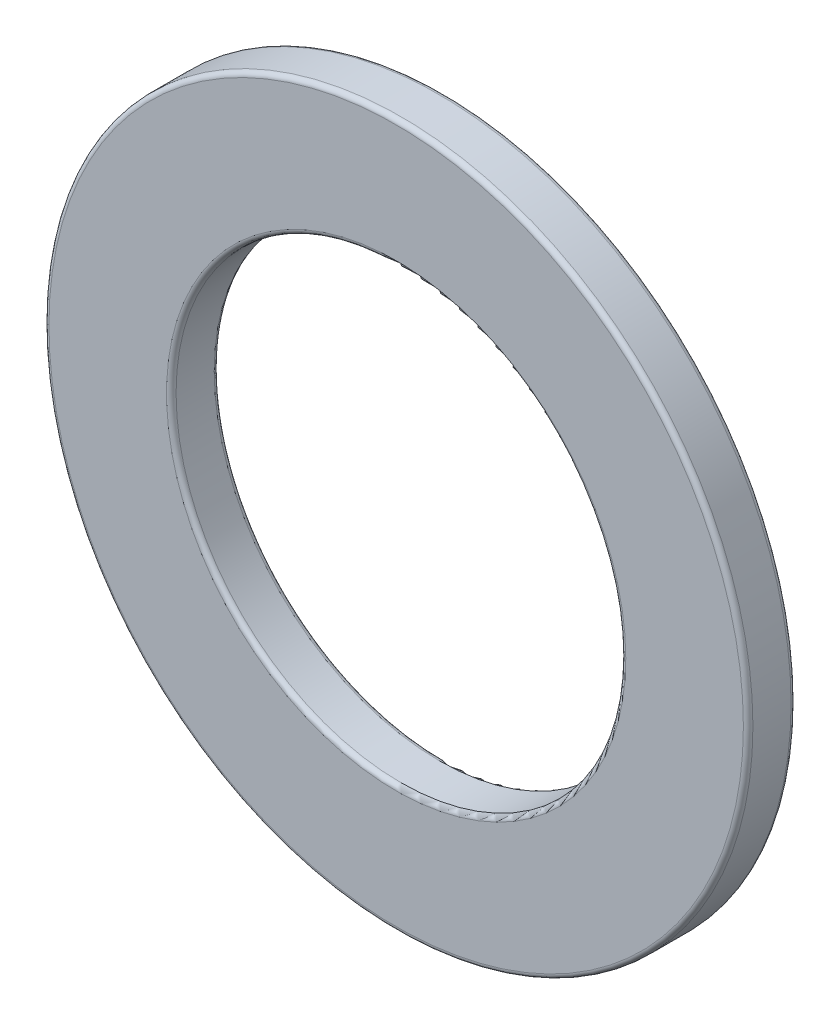
ISO-10303-21;
HEADER;
FILE_DESCRIPTION(('STEP AP214'),'2;1');
FILE_NAME('part.step','',(''),(''),'','','');
FILE_SCHEMA(('AUTOMOTIVE_DESIGN { 1 0 10303 214 1 1 1 1 }'));
ENDSEC;
DATA;
#1=APPLICATION_CONTEXT('core data for automotive mechanical design processes');
#2=APPLICATION_PROTOCOL_DEFINITION('international standard','automotive_design',2000,#1);
#3=PRODUCT_CONTEXT('',#1,'mechanical');
#4=PRODUCT('Part','Part','',(#3));
#5=PRODUCT_RELATED_PRODUCT_CATEGORY('part','',(#4));
#6=PRODUCT_DEFINITION_FORMATION('','',#4);
#7=PRODUCT_DEFINITION_CONTEXT('part definition',#1,'design');
#8=PRODUCT_DEFINITION('design','',#6,#7);
#9=PRODUCT_DEFINITION_SHAPE('','',#8);
#10=(LENGTH_UNIT() NAMED_UNIT(*) SI_UNIT(.MILLI.,.METRE.));
#11=(NAMED_UNIT(*) PLANE_ANGLE_UNIT() SI_UNIT($,.RADIAN.));
#12=(NAMED_UNIT(*) SI_UNIT($,.STERADIAN.) SOLID_ANGLE_UNIT());
#13=UNCERTAINTY_MEASURE_WITH_UNIT(LENGTH_MEASURE(1.E-05),#10,'distance_accuracy_value','');
#14=(GEOMETRIC_REPRESENTATION_CONTEXT(3) GLOBAL_UNCERTAINTY_ASSIGNED_CONTEXT((#13)) GLOBAL_UNIT_ASSIGNED_CONTEXT((#10,
#11,#12)) REPRESENTATION_CONTEXT('',''));
#15=CARTESIAN_POINT('',(0.,0.,0.));
#16=DIRECTION('',(0.,0.,1.));
#17=DIRECTION('',(1.,0.,0.));
#18=AXIS2_PLACEMENT_3D('',#15,#16,#17);
#19=CARTESIAN_POINT('',(0.,0.,-1.5));
#20=DIRECTION('',(0.,0.,1.));
#21=DIRECTION('',(1.,0.,0.));
#22=AXIS2_PLACEMENT_3D('',#19,#20,#21);
#23=CYLINDRICAL_SURFACE('',#22,11.075);
#24=CARTESIAN_POINT('',(0.,0.,-0.15));
#25=DIRECTION('',(0.,0.,1.));
#26=DIRECTION('',(1.,0.,0.));
#27=AXIS2_PLACEMENT_3D('',#24,#25,#26);
#28=CIRCLE('',#27,11.075);
#29=CARTESIAN_POINT('',(11.075,0.,-0.15));
#30=VERTEX_POINT('',#29);
#31=EDGE_CURVE('E63',#30,#30,#28,.F.);
#32=ORIENTED_EDGE('',*,*,#31,.T.);
#33=EDGE_LOOP('',(#32));
#34=FACE_BOUND('',#33,.T.);
#35=CARTESIAN_POINT('',(0.,0.,-1.35));
#36=DIRECTION('',(0.,0.,1.));
#37=DIRECTION('',(1.,0.,0.));
#38=AXIS2_PLACEMENT_3D('',#35,#36,#37);
#39=CIRCLE('',#38,11.075);
#40=CARTESIAN_POINT('',(11.075,0.,-1.35));
#41=VERTEX_POINT('',#40);
#42=EDGE_CURVE('E66',#41,#41,#39,.T.);
#43=ORIENTED_EDGE('',*,*,#42,.T.);
#44=EDGE_LOOP('',(#43));
#45=FACE_BOUND('',#44,.T.);
#46=ADVANCED_FACE('F43',(#34,#45),#23,.T.);
#47=CARTESIAN_POINT('',(0.,0.,-1.5));
#48=DIRECTION('',(0.,0.,1.));
#49=DIRECTION('',(1.,0.,0.));
#50=AXIS2_PLACEMENT_3D('',#47,#48,#49);
#51=PLANE('',#50);
#52=CARTESIAN_POINT('',(0.,0.,-1.5));
#53=DIRECTION('',(0.,0.,1.));
#54=DIRECTION('',(1.,0.,0.));
#55=AXIS2_PLACEMENT_3D('',#52,#53,#54);
#56=CIRCLE('',#55,10.925);
#57=CARTESIAN_POINT('',(10.925,0.,-1.5));
#58=VERTEX_POINT('',#57);
#59=EDGE_CURVE('E54',#58,#58,#56,.F.);
#60=ORIENTED_EDGE('',*,*,#59,.T.);
#61=EDGE_LOOP('',(#60));
#62=FACE_BOUND('',#61,.T.);
#63=CARTESIAN_POINT('',(0.,0.,-1.5));
#64=DIRECTION('',(0.,0.,1.));
#65=DIRECTION('',(1.,0.,0.));
#66=AXIS2_PLACEMENT_3D('',#63,#64,#65);
#67=CIRCLE('',#66,7.225);
#68=CARTESIAN_POINT('',(7.225,0.,-1.5));
#69=VERTEX_POINT('',#68);
#70=EDGE_CURVE('E58',#69,#69,#67,.T.);
#71=ORIENTED_EDGE('',*,*,#70,.T.);
#72=EDGE_LOOP('',(#71));
#73=FACE_BOUND('',#72,.T.);
#74=ADVANCED_FACE('F91',(#62,#73),#51,.F.);
#75=CARTESIAN_POINT('',(0.,0.,0.));
#76=DIRECTION('',(0.,0.,1.));
#77=DIRECTION('',(1.,0.,0.));
#78=AXIS2_PLACEMENT_3D('',#75,#76,#77);
#79=PLANE('',#78);
#80=CARTESIAN_POINT('',(0.,0.,0.));
#81=DIRECTION('',(0.,0.,1.));
#82=DIRECTION('',(1.,0.,0.));
#83=AXIS2_PLACEMENT_3D('',#80,#81,#82);
#84=CIRCLE('',#83,10.925);
#85=CARTESIAN_POINT('',(10.925,0.,0.));
#86=VERTEX_POINT('',#85);
#87=EDGE_CURVE('E69',#86,#86,#84,.T.);
#88=ORIENTED_EDGE('',*,*,#87,.T.);
#89=EDGE_LOOP('',(#88));
#90=FACE_BOUND('',#89,.T.);
#91=CARTESIAN_POINT('',(0.,0.,0.));
#92=DIRECTION('',(0.,0.,1.));
#93=DIRECTION('',(1.,0.,0.));
#94=AXIS2_PLACEMENT_3D('',#91,#92,#93);
#95=CIRCLE('',#94,7.225);
#96=CARTESIAN_POINT('',(7.225,0.,0.));
#97=VERTEX_POINT('',#96);
#98=EDGE_CURVE('E72',#97,#97,#95,.F.);
#99=ORIENTED_EDGE('',*,*,#98,.T.);
#100=EDGE_LOOP('',(#99));
#101=FACE_BOUND('',#100,.T.);
#102=ADVANCED_FACE('F76',(#90,#101),#79,.T.);
#103=CARTESIAN_POINT('',(0.,0.,-1.5));
#104=DIRECTION('',(0.,0.,1.));
#105=DIRECTION('',(1.,0.,0.));
#106=AXIS2_PLACEMENT_3D('',#103,#104,#105);
#107=CYLINDRICAL_SURFACE('',#106,7.075);
#108=CARTESIAN_POINT('',(0.,0.,-0.15));
#109=DIRECTION('',(0.,0.,1.));
#110=DIRECTION('',(1.,0.,0.));
#111=AXIS2_PLACEMENT_3D('',#108,#109,#110);
#112=CIRCLE('',#111,7.075);
#113=CARTESIAN_POINT('',(7.075,0.,-0.15));
#114=VERTEX_POINT('',#113);
#115=EDGE_CURVE('E10',#114,#114,#112,.T.);
#116=ORIENTED_EDGE('',*,*,#115,.T.);
#117=EDGE_LOOP('',(#116));
#118=FACE_BOUND('',#117,.T.);
#119=CARTESIAN_POINT('',(0.,0.,-1.35));
#120=DIRECTION('',(0.,0.,1.));
#121=DIRECTION('',(1.,0.,0.));
#122=AXIS2_PLACEMENT_3D('',#119,#120,#121);
#123=CIRCLE('',#122,7.075);
#124=CARTESIAN_POINT('',(7.075,0.,-1.35));
#125=VERTEX_POINT('',#124);
#126=EDGE_CURVE('E50',#125,#125,#123,.F.);
#127=ORIENTED_EDGE('',*,*,#126,.T.);
#128=EDGE_LOOP('',(#127));
#129=FACE_BOUND('',#128,.T.);
#130=ADVANCED_FACE('F103',(#118,#129),#107,.F.);
#131=CARTESIAN_POINT('',(0.,0.,-0.15));
#132=DIRECTION('',(0.,0.,1.));
#133=DIRECTION('',(1.,0.,0.));
#134=AXIS2_PLACEMENT_3D('',#131,#132,#133);
#135=TOROIDAL_SURFACE('',#134,10.925,0.15);
#136=ORIENTED_EDGE('',*,*,#31,.F.);
#137=EDGE_LOOP('',(#136));
#138=FACE_BOUND('',#137,.T.);
#139=ORIENTED_EDGE('',*,*,#87,.F.);
#140=EDGE_LOOP('',(#139));
#141=FACE_BOUND('',#140,.T.);
#142=ADVANCED_FACE('F87',(#138,#141),#135,.T.);
#143=CARTESIAN_POINT('',(0.,0.,-1.35));
#144=DIRECTION('',(0.,0.,1.));
#145=DIRECTION('',(1.,0.,0.));
#146=AXIS2_PLACEMENT_3D('',#143,#144,#145);
#147=TOROIDAL_SURFACE('',#146,10.925,0.15);
#148=ORIENTED_EDGE('',*,*,#59,.F.);
#149=EDGE_LOOP('',(#148));
#150=FACE_BOUND('',#149,.T.);
#151=ORIENTED_EDGE('',*,*,#42,.F.);
#152=EDGE_LOOP('',(#151));
#153=FACE_BOUND('',#152,.T.);
#154=ADVANCED_FACE('F81',(#150,#153),#147,.T.);
#155=CARTESIAN_POINT('',(0.,0.,-0.15));
#156=DIRECTION('',(0.,0.,1.));
#157=DIRECTION('',(1.,0.,0.));
#158=AXIS2_PLACEMENT_3D('',#155,#156,#157);
#159=TOROIDAL_SURFACE('',#158,7.225,0.15);
#160=ORIENTED_EDGE('',*,*,#98,.F.);
#161=EDGE_LOOP('',(#160));
#162=FACE_BOUND('',#161,.T.);
#163=ORIENTED_EDGE('',*,*,#115,.F.);
#164=EDGE_LOOP('',(#163));
#165=FACE_BOUND('',#164,.T.);
#166=ADVANCED_FACE('F78',(#162,#165),#159,.T.);
#167=CARTESIAN_POINT('',(0.,0.,-1.35));
#168=DIRECTION('',(0.,0.,1.));
#169=DIRECTION('',(1.,0.,0.));
#170=AXIS2_PLACEMENT_3D('',#167,#168,#169);
#171=TOROIDAL_SURFACE('',#170,7.225,0.15);
#172=ORIENTED_EDGE('',*,*,#126,.F.);
#173=EDGE_LOOP('',(#172));
#174=FACE_BOUND('',#173,.T.);
#175=ORIENTED_EDGE('',*,*,#70,.F.);
#176=EDGE_LOOP('',(#175));
#177=FACE_BOUND('',#176,.T.);
#178=ADVANCED_FACE('F45',(#174,#177),#171,.T.);
#179=CLOSED_SHELL('',(#46,#74,#102,#130,#142,#154,#166,#178));
#180=MANIFOLD_SOLID_BREP('B2',#179);
#181=ADVANCED_BREP_SHAPE_REPRESENTATION('',(#18,#180),#14);
#182=SHAPE_DEFINITION_REPRESENTATION(#9,#181);
ENDSEC;
END-ISO-10303-21;
